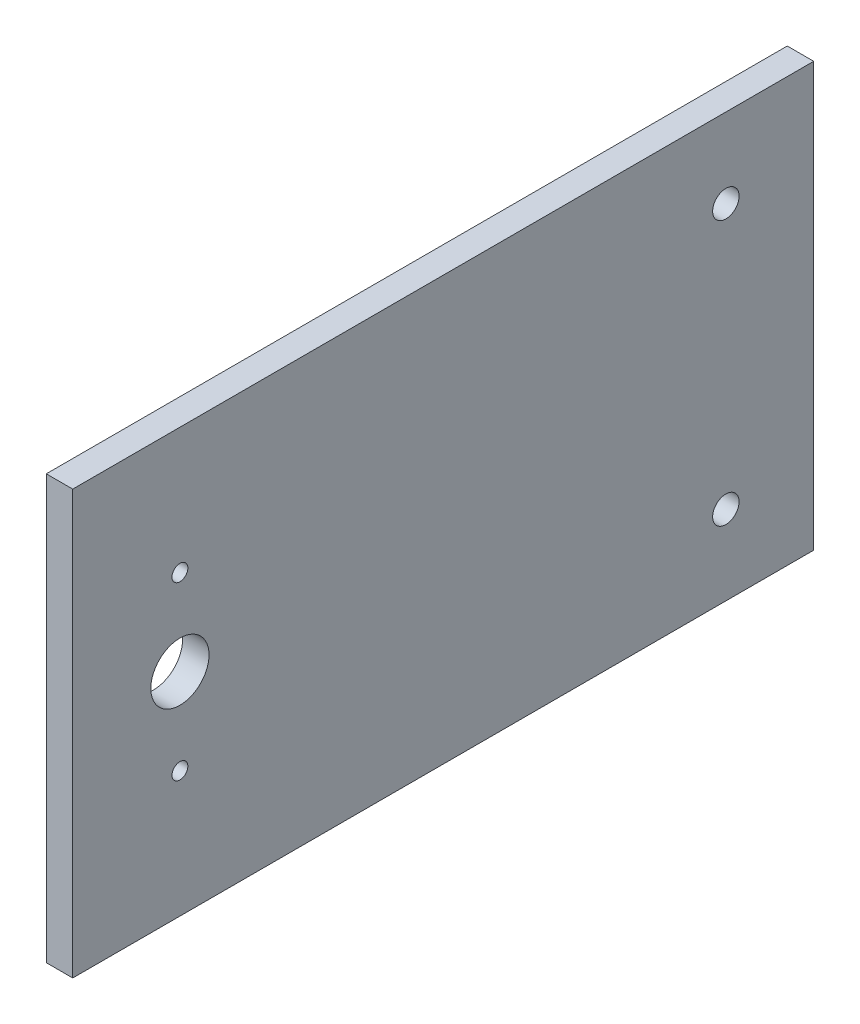
ISO-10303-21;
HEADER;
FILE_DESCRIPTION(('STEP AP214'),'2;1');
FILE_NAME('part.step','',(''),(''),'','','');
FILE_SCHEMA(('AUTOMOTIVE_DESIGN { 1 0 10303 214 1 1 1 1 }'));
ENDSEC;
DATA;
#1=APPLICATION_CONTEXT('core data for automotive mechanical design processes');
#2=APPLICATION_PROTOCOL_DEFINITION('international standard','automotive_design',2000,#1);
#3=PRODUCT_CONTEXT('',#1,'mechanical');
#4=PRODUCT('Part','Part','',(#3));
#5=PRODUCT_RELATED_PRODUCT_CATEGORY('part','',(#4));
#6=PRODUCT_DEFINITION_FORMATION('','',#4);
#7=PRODUCT_DEFINITION_CONTEXT('part definition',#1,'design');
#8=PRODUCT_DEFINITION('design','',#6,#7);
#9=PRODUCT_DEFINITION_SHAPE('','',#8);
#10=(LENGTH_UNIT() NAMED_UNIT(*) SI_UNIT(.MILLI.,.METRE.));
#11=(NAMED_UNIT(*) PLANE_ANGLE_UNIT() SI_UNIT($,.RADIAN.));
#12=(NAMED_UNIT(*) SI_UNIT($,.STERADIAN.) SOLID_ANGLE_UNIT());
#13=UNCERTAINTY_MEASURE_WITH_UNIT(LENGTH_MEASURE(1.E-05),#10,'distance_accuracy_value','');
#14=(GEOMETRIC_REPRESENTATION_CONTEXT(3) GLOBAL_UNCERTAINTY_ASSIGNED_CONTEXT((#13)) GLOBAL_UNIT_ASSIGNED_CONTEXT((#10,
#11,#12)) REPRESENTATION_CONTEXT('',''));
#15=CARTESIAN_POINT('',(0.,0.,0.));
#16=DIRECTION('',(0.,0.,1.));
#17=DIRECTION('',(1.,0.,0.));
#18=AXIS2_PLACEMENT_3D('',#15,#16,#17);
#19=CARTESIAN_POINT('',(5.,0.,0.));
#20=DIRECTION('',(-1.,0.,0.));
#21=DIRECTION('',(0.,0.,1.));
#22=AXIS2_PLACEMENT_3D('',#19,#20,#21);
#23=PLANE('',#22);
#24=DIRECTION('',(0.,0.,1.));
#25=VECTOR('',#24,1.);
#26=CARTESIAN_POINT('',(5.,40.,-70.));
#27=LINE('',#26,#25);
#28=CARTESIAN_POINT('',(5.,40.,-70.));
#29=VERTEX_POINT('',#28);
#30=CARTESIAN_POINT('',(5.,40.,70.));
#31=VERTEX_POINT('',#30);
#32=EDGE_CURVE('E98',#29,#31,#27,.T.);
#33=ORIENTED_EDGE('',*,*,#32,.T.);
#34=DIRECTION('',(0.,-1.,0.));
#35=VECTOR('',#34,1.);
#36=CARTESIAN_POINT('',(5.,-40.,70.));
#37=LINE('',#36,#35);
#38=CARTESIAN_POINT('',(5.,-40.,70.));
#39=VERTEX_POINT('',#38);
#40=EDGE_CURVE('E93',#31,#39,#37,.T.);
#41=ORIENTED_EDGE('',*,*,#40,.T.);
#42=DIRECTION('',(0.,0.,-1.));
#43=VECTOR('',#42,1.);
#44=CARTESIAN_POINT('',(5.,-40.,-70.));
#45=LINE('',#44,#43);
#46=CARTESIAN_POINT('',(5.,-40.,-70.));
#47=VERTEX_POINT('',#46);
#48=EDGE_CURVE('E96',#39,#47,#45,.T.);
#49=ORIENTED_EDGE('',*,*,#48,.T.);
#50=DIRECTION('',(0.,1.,0.));
#51=VECTOR('',#50,1.);
#52=CARTESIAN_POINT('',(5.,-40.,-70.));
#53=LINE('',#52,#51);
#54=EDGE_CURVE('E63',#47,#29,#53,.T.);
#55=ORIENTED_EDGE('',*,*,#54,.T.);
#56=EDGE_LOOP('',(#33,#41,#49,#55));
#57=FACE_BOUND('',#56,.T.);
#58=CARTESIAN_POINT('',(5.,-16.22,49.75));
#59=DIRECTION('',(1.,0.,0.));
#60=DIRECTION('',(0.,0.,-1.));
#61=AXIS2_PLACEMENT_3D('',#58,#59,#60);
#62=CIRCLE('',#61,1.5);
#63=CARTESIAN_POINT('',(5.,-16.22,48.2499999999999));
#64=VERTEX_POINT('',#63);
#65=EDGE_CURVE('E118',#64,#64,#62,.T.);
#66=ORIENTED_EDGE('',*,*,#65,.F.);
#67=EDGE_LOOP('',(#66));
#68=FACE_BOUND('',#67,.T.);
#69=CARTESIAN_POINT('',(5.,16.22,49.75));
#70=DIRECTION('',(1.,0.,0.));
#71=DIRECTION('',(0.,0.,1.));
#72=AXIS2_PLACEMENT_3D('',#69,#70,#71);
#73=CIRCLE('',#72,1.5);
#74=CARTESIAN_POINT('',(5.,16.22,51.25));
#75=VERTEX_POINT('',#74);
#76=EDGE_CURVE('E140',#75,#75,#73,.T.);
#77=ORIENTED_EDGE('',*,*,#76,.F.);
#78=EDGE_LOOP('',(#77));
#79=FACE_BOUND('',#78,.T.);
#80=CARTESIAN_POINT('',(5.,0.,49.75));
#81=DIRECTION('',(1.,0.,0.));
#82=DIRECTION('',(0.,0.,-1.));
#83=AXIS2_PLACEMENT_3D('',#80,#81,#82);
#84=CIRCLE('',#83,5.5);
#85=CARTESIAN_POINT('',(5.,0.,44.25));
#86=VERTEX_POINT('',#85);
#87=EDGE_CURVE('E148',#86,#86,#84,.T.);
#88=ORIENTED_EDGE('',*,*,#87,.F.);
#89=EDGE_LOOP('',(#88));
#90=FACE_BOUND('',#89,.T.);
#91=CARTESIAN_POINT('',(5.,-25.,-53.4));
#92=DIRECTION('',(1.,0.,0.));
#93=DIRECTION('',(0.,0.,-1.));
#94=AXIS2_PLACEMENT_3D('',#91,#92,#93);
#95=CIRCLE('',#94,2.5);
#96=CARTESIAN_POINT('',(5.,-25.,-55.9));
#97=VERTEX_POINT('',#96);
#98=EDGE_CURVE('E156',#97,#97,#95,.T.);
#99=ORIENTED_EDGE('',*,*,#98,.F.);
#100=EDGE_LOOP('',(#99));
#101=FACE_BOUND('',#100,.T.);
#102=CARTESIAN_POINT('',(5.,25.,-53.4));
#103=DIRECTION('',(1.,0.,0.));
#104=DIRECTION('',(0.,0.,-1.));
#105=AXIS2_PLACEMENT_3D('',#102,#103,#104);
#106=CIRCLE('',#105,2.5);
#107=CARTESIAN_POINT('',(5.,25.,-55.9));
#108=VERTEX_POINT('',#107);
#109=EDGE_CURVE('E164',#108,#108,#106,.T.);
#110=ORIENTED_EDGE('',*,*,#109,.F.);
#111=EDGE_LOOP('',(#110));
#112=FACE_BOUND('',#111,.T.);
#113=ADVANCED_FACE('F45',(#57,#68,#79,#90,#101,#112),#23,.F.);
#114=CARTESIAN_POINT('',(0.,0.,0.));
#115=DIRECTION('',(-1.,0.,0.));
#116=DIRECTION('',(0.,0.,1.));
#117=AXIS2_PLACEMENT_3D('',#114,#115,#116);
#118=PLANE('',#117);
#119=CARTESIAN_POINT('',(0.,-25.,-53.4));
#120=DIRECTION('',(1.,0.,0.));
#121=DIRECTION('',(0.,0.,-1.));
#122=AXIS2_PLACEMENT_3D('',#119,#120,#121);
#123=CIRCLE('',#122,2.5);
#124=CARTESIAN_POINT('',(0.,-25.,-55.9));
#125=VERTEX_POINT('',#124);
#126=EDGE_CURVE('E160',#125,#125,#123,.T.);
#127=ORIENTED_EDGE('',*,*,#126,.T.);
#128=EDGE_LOOP('',(#127));
#129=FACE_BOUND('',#128,.T.);
#130=CARTESIAN_POINT('',(0.,16.22,49.75));
#131=DIRECTION('',(1.,0.,0.));
#132=DIRECTION('',(0.,0.,1.));
#133=AXIS2_PLACEMENT_3D('',#130,#131,#132);
#134=CIRCLE('',#133,1.5);
#135=CARTESIAN_POINT('',(0.,16.22,51.25));
#136=VERTEX_POINT('',#135);
#137=EDGE_CURVE('E144',#136,#136,#134,.T.);
#138=ORIENTED_EDGE('',*,*,#137,.T.);
#139=EDGE_LOOP('',(#138));
#140=FACE_BOUND('',#139,.T.);
#141=DIRECTION('',(0.,0.,1.));
#142=VECTOR('',#141,1.);
#143=CARTESIAN_POINT('',(0.,40.,-70.));
#144=LINE('',#143,#142);
#145=CARTESIAN_POINT('',(0.,40.,-70.));
#146=VERTEX_POINT('',#145);
#147=CARTESIAN_POINT('',(0.,40.,70.));
#148=VERTEX_POINT('',#147);
#149=EDGE_CURVE('E114',#146,#148,#144,.T.);
#150=ORIENTED_EDGE('',*,*,#149,.F.);
#151=DIRECTION('',(0.,1.,0.));
#152=VECTOR('',#151,1.);
#153=CARTESIAN_POINT('',(0.,-40.,-70.));
#154=LINE('',#153,#152);
#155=CARTESIAN_POINT('',(0.,-40.,-70.));
#156=VERTEX_POINT('',#155);
#157=EDGE_CURVE('E86',#156,#146,#154,.T.);
#158=ORIENTED_EDGE('',*,*,#157,.F.);
#159=DIRECTION('',(0.,0.,-1.));
#160=VECTOR('',#159,1.);
#161=CARTESIAN_POINT('',(0.,-40.,-70.));
#162=LINE('',#161,#160);
#163=CARTESIAN_POINT('',(0.,-40.,70.));
#164=VERTEX_POINT('',#163);
#165=EDGE_CURVE('E80',#164,#156,#162,.T.);
#166=ORIENTED_EDGE('',*,*,#165,.F.);
#167=DIRECTION('',(0.,-1.,0.));
#168=VECTOR('',#167,1.);
#169=CARTESIAN_POINT('',(0.,-40.,70.));
#170=LINE('',#169,#168);
#171=EDGE_CURVE('E103',#148,#164,#170,.T.);
#172=ORIENTED_EDGE('',*,*,#171,.F.);
#173=EDGE_LOOP('',(#150,#158,#166,#172));
#174=FACE_BOUND('',#173,.T.);
#175=CARTESIAN_POINT('',(0.,-16.22,49.75));
#176=DIRECTION('',(1.,0.,0.));
#177=DIRECTION('',(0.,0.,-1.));
#178=AXIS2_PLACEMENT_3D('',#175,#176,#177);
#179=CIRCLE('',#178,1.5);
#180=CARTESIAN_POINT('',(0.,-16.22,48.2499999999999));
#181=VERTEX_POINT('',#180);
#182=EDGE_CURVE('E136',#181,#181,#179,.T.);
#183=ORIENTED_EDGE('',*,*,#182,.T.);
#184=EDGE_LOOP('',(#183));
#185=FACE_BOUND('',#184,.T.);
#186=CARTESIAN_POINT('',(0.,0.,49.75));
#187=DIRECTION('',(1.,0.,0.));
#188=DIRECTION('',(0.,0.,-1.));
#189=AXIS2_PLACEMENT_3D('',#186,#187,#188);
#190=CIRCLE('',#189,5.5);
#191=CARTESIAN_POINT('',(0.,0.,44.25));
#192=VERTEX_POINT('',#191);
#193=EDGE_CURVE('E152',#192,#192,#190,.T.);
#194=ORIENTED_EDGE('',*,*,#193,.T.);
#195=EDGE_LOOP('',(#194));
#196=FACE_BOUND('',#195,.T.);
#197=CARTESIAN_POINT('',(0.,25.,-53.4));
#198=DIRECTION('',(1.,0.,0.));
#199=DIRECTION('',(0.,0.,-1.));
#200=AXIS2_PLACEMENT_3D('',#197,#198,#199);
#201=CIRCLE('',#200,2.5);
#202=CARTESIAN_POINT('',(0.,25.,-55.9));
#203=VERTEX_POINT('',#202);
#204=EDGE_CURVE('E168',#203,#203,#201,.T.);
#205=ORIENTED_EDGE('',*,*,#204,.T.);
#206=EDGE_LOOP('',(#205));
#207=FACE_BOUND('',#206,.T.);
#208=ADVANCED_FACE('F131',(#129,#140,#174,#185,#196,#207),#118,.T.);
#209=CARTESIAN_POINT('',(5.,40.,-70.));
#210=DIRECTION('',(0.,-1.,0.));
#211=DIRECTION('',(0.,0.,-1.));
#212=AXIS2_PLACEMENT_3D('',#209,#210,#211);
#213=PLANE('',#212);
#214=ORIENTED_EDGE('',*,*,#149,.T.);
#215=DIRECTION('',(-1.,0.,0.));
#216=VECTOR('',#215,1.);
#217=CARTESIAN_POINT('',(5.,40.,70.));
#218=LINE('',#217,#216);
#219=EDGE_CURVE('E11',#31,#148,#218,.T.);
#220=ORIENTED_EDGE('',*,*,#219,.F.);
#221=ORIENTED_EDGE('',*,*,#32,.F.);
#222=DIRECTION('',(-1.,0.,0.));
#223=VECTOR('',#222,1.);
#224=CARTESIAN_POINT('',(5.,40.,-70.));
#225=LINE('',#224,#223);
#226=EDGE_CURVE('E110',#29,#146,#225,.T.);
#227=ORIENTED_EDGE('',*,*,#226,.T.);
#228=EDGE_LOOP('',(#214,#220,#221,#227));
#229=FACE_BOUND('',#228,.T.);
#230=ADVANCED_FACE('F47',(#229),#213,.F.);
#231=CARTESIAN_POINT('',(5.,-40.,70.));
#232=DIRECTION('',(0.,0.,-1.));
#233=DIRECTION('',(0.,1.,0.));
#234=AXIS2_PLACEMENT_3D('',#231,#232,#233);
#235=PLANE('',#234);
#236=ORIENTED_EDGE('',*,*,#171,.T.);
#237=DIRECTION('',(-1.,0.,0.));
#238=VECTOR('',#237,1.);
#239=CARTESIAN_POINT('',(5.,-40.,70.));
#240=LINE('',#239,#238);
#241=EDGE_CURVE('E55',#39,#164,#240,.T.);
#242=ORIENTED_EDGE('',*,*,#241,.F.);
#243=ORIENTED_EDGE('',*,*,#40,.F.);
#244=ORIENTED_EDGE('',*,*,#219,.T.);
#245=EDGE_LOOP('',(#236,#242,#243,#244));
#246=FACE_BOUND('',#245,.T.);
#247=ADVANCED_FACE('F102',(#246),#235,.F.);
#248=CARTESIAN_POINT('',(5.,-40.,-70.));
#249=DIRECTION('',(0.,1.,0.));
#250=DIRECTION('',(0.,0.,1.));
#251=AXIS2_PLACEMENT_3D('',#248,#249,#250);
#252=PLANE('',#251);
#253=ORIENTED_EDGE('',*,*,#165,.T.);
#254=DIRECTION('',(-1.,0.,0.));
#255=VECTOR('',#254,1.);
#256=CARTESIAN_POINT('',(5.,-40.,-70.));
#257=LINE('',#256,#255);
#258=EDGE_CURVE('E105',#47,#156,#257,.T.);
#259=ORIENTED_EDGE('',*,*,#258,.F.);
#260=ORIENTED_EDGE('',*,*,#48,.F.);
#261=ORIENTED_EDGE('',*,*,#241,.T.);
#262=EDGE_LOOP('',(#253,#259,#260,#261));
#263=FACE_BOUND('',#262,.T.);
#264=ADVANCED_FACE('F106',(#263),#252,.F.);
#265=CARTESIAN_POINT('',(5.,-40.,-70.));
#266=DIRECTION('',(0.,0.,1.));
#267=DIRECTION('',(1.,0.,0.));
#268=AXIS2_PLACEMENT_3D('',#265,#266,#267);
#269=PLANE('',#268);
#270=ORIENTED_EDGE('',*,*,#157,.T.);
#271=ORIENTED_EDGE('',*,*,#226,.F.);
#272=ORIENTED_EDGE('',*,*,#54,.F.);
#273=ORIENTED_EDGE('',*,*,#258,.T.);
#274=EDGE_LOOP('',(#270,#271,#272,#273));
#275=FACE_BOUND('',#274,.T.);
#276=ADVANCED_FACE('F128',(#275),#269,.F.);
#277=CARTESIAN_POINT('',(5.,-16.22,49.75));
#278=DIRECTION('',(-1.,0.,0.));
#279=DIRECTION('',(0.,0.,1.));
#280=AXIS2_PLACEMENT_3D('',#277,#278,#279);
#281=CYLINDRICAL_SURFACE('',#280,1.5);
#282=ORIENTED_EDGE('',*,*,#65,.T.);
#283=EDGE_LOOP('',(#282));
#284=FACE_BOUND('',#283,.T.);
#285=ORIENTED_EDGE('',*,*,#182,.F.);
#286=EDGE_LOOP('',(#285));
#287=FACE_BOUND('',#286,.T.);
#288=ADVANCED_FACE('F187',(#284,#287),#281,.F.);
#289=CARTESIAN_POINT('',(5.,16.22,49.75));
#290=DIRECTION('',(-1.,0.,0.));
#291=DIRECTION('',(0.,0.,1.));
#292=AXIS2_PLACEMENT_3D('',#289,#290,#291);
#293=CYLINDRICAL_SURFACE('',#292,1.5);
#294=ORIENTED_EDGE('',*,*,#76,.T.);
#295=EDGE_LOOP('',(#294));
#296=FACE_BOUND('',#295,.T.);
#297=ORIENTED_EDGE('',*,*,#137,.F.);
#298=EDGE_LOOP('',(#297));
#299=FACE_BOUND('',#298,.T.);
#300=ADVANCED_FACE('F232',(#296,#299),#293,.F.);
#301=CARTESIAN_POINT('',(5.,0.,49.75));
#302=DIRECTION('',(-1.,0.,0.));
#303=DIRECTION('',(0.,0.,1.));
#304=AXIS2_PLACEMENT_3D('',#301,#302,#303);
#305=CYLINDRICAL_SURFACE('',#304,5.5);
#306=ORIENTED_EDGE('',*,*,#87,.T.);
#307=EDGE_LOOP('',(#306));
#308=FACE_BOUND('',#307,.T.);
#309=ORIENTED_EDGE('',*,*,#193,.F.);
#310=EDGE_LOOP('',(#309));
#311=FACE_BOUND('',#310,.T.);
#312=ADVANCED_FACE('F240',(#308,#311),#305,.F.);
#313=CARTESIAN_POINT('',(5.,-25.,-53.4));
#314=DIRECTION('',(-1.,0.,0.));
#315=DIRECTION('',(0.,0.,1.));
#316=AXIS2_PLACEMENT_3D('',#313,#314,#315);
#317=CYLINDRICAL_SURFACE('',#316,2.5);
#318=ORIENTED_EDGE('',*,*,#98,.T.);
#319=EDGE_LOOP('',(#318));
#320=FACE_BOUND('',#319,.T.);
#321=ORIENTED_EDGE('',*,*,#126,.F.);
#322=EDGE_LOOP('',(#321));
#323=FACE_BOUND('',#322,.T.);
#324=ADVANCED_FACE('F248',(#320,#323),#317,.F.);
#325=CARTESIAN_POINT('',(5.,25.,-53.4));
#326=DIRECTION('',(-1.,0.,0.));
#327=DIRECTION('',(0.,0.,1.));
#328=AXIS2_PLACEMENT_3D('',#325,#326,#327);
#329=CYLINDRICAL_SURFACE('',#328,2.5);
#330=ORIENTED_EDGE('',*,*,#109,.T.);
#331=EDGE_LOOP('',(#330));
#332=FACE_BOUND('',#331,.T.);
#333=ORIENTED_EDGE('',*,*,#204,.F.);
#334=EDGE_LOOP('',(#333));
#335=FACE_BOUND('',#334,.T.);
#336=ADVANCED_FACE('F176',(#332,#335),#329,.F.);
#337=CLOSED_SHELL('',(#113,#208,#230,#247,#264,#276,#288,#300,#312,#324,#336));
#338=MANIFOLD_SOLID_BREP('B2',#337);
#339=ADVANCED_BREP_SHAPE_REPRESENTATION('',(#18,#338),#14);
#340=SHAPE_DEFINITION_REPRESENTATION(#9,#339);
ENDSEC;
END-ISO-10303-21;
